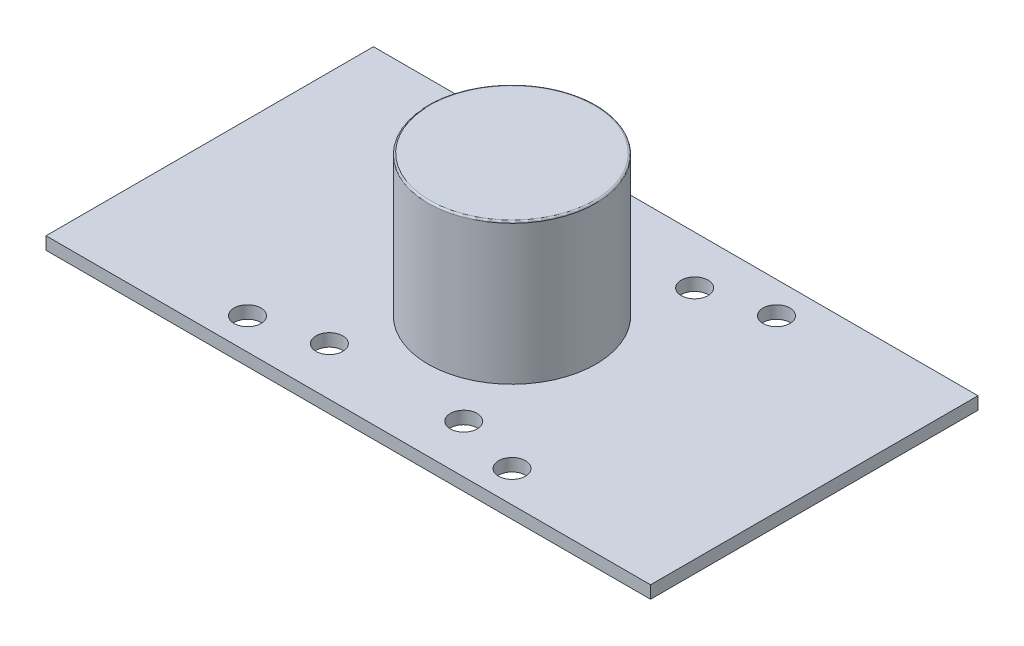
ISO-10303-21;
HEADER;
FILE_DESCRIPTION(('STEP AP214'),'2;1');
FILE_NAME('part.step','',(''),(''),'','','');
FILE_SCHEMA(('AUTOMOTIVE_DESIGN { 1 0 10303 214 1 1 1 1 }'));
ENDSEC;
DATA;
#1=APPLICATION_CONTEXT('core data for automotive mechanical design processes');
#2=APPLICATION_PROTOCOL_DEFINITION('international standard','automotive_design',2000,#1);
#3=PRODUCT_CONTEXT('',#1,'mechanical');
#4=PRODUCT('Part','Part','',(#3));
#5=PRODUCT_RELATED_PRODUCT_CATEGORY('part','',(#4));
#6=PRODUCT_DEFINITION_FORMATION('','',#4);
#7=PRODUCT_DEFINITION_CONTEXT('part definition',#1,'design');
#8=PRODUCT_DEFINITION('design','',#6,#7);
#9=PRODUCT_DEFINITION_SHAPE('','',#8);
#10=(LENGTH_UNIT() NAMED_UNIT(*) SI_UNIT(.MILLI.,.METRE.));
#11=(NAMED_UNIT(*) PLANE_ANGLE_UNIT() SI_UNIT($,.RADIAN.));
#12=(NAMED_UNIT(*) SI_UNIT($,.STERADIAN.) SOLID_ANGLE_UNIT());
#13=UNCERTAINTY_MEASURE_WITH_UNIT(LENGTH_MEASURE(1.E-05),#10,'distance_accuracy_value','');
#14=(GEOMETRIC_REPRESENTATION_CONTEXT(3) GLOBAL_UNCERTAINTY_ASSIGNED_CONTEXT((#13)) GLOBAL_UNIT_ASSIGNED_CONTEXT((#10,
#11,#12)) REPRESENTATION_CONTEXT('',''));
#15=CARTESIAN_POINT('',(0.,0.,0.));
#16=DIRECTION('',(0.,0.,1.));
#17=DIRECTION('',(1.,0.,0.));
#18=AXIS2_PLACEMENT_3D('',#15,#16,#17);
#19=CARTESIAN_POINT('',(0.,1.5,-39.));
#20=DIRECTION('',(1.,0.,0.));
#21=DIRECTION('',(0.,0.,-1.));
#22=AXIS2_PLACEMENT_3D('',#19,#20,#21);
#23=PLANE('',#22);
#24=DIRECTION('',(0.,0.,1.));
#25=VECTOR('',#24,1.);
#26=CARTESIAN_POINT('',(0.,0.,-39.));
#27=LINE('',#26,#25);
#28=CARTESIAN_POINT('',(0.,0.,-39.));
#29=VERTEX_POINT('',#28);
#30=CARTESIAN_POINT('',(0.,0.,0.));
#31=VERTEX_POINT('',#30);
#32=EDGE_CURVE('E103',#29,#31,#27,.T.);
#33=ORIENTED_EDGE('',*,*,#32,.T.);
#34=DIRECTION('',(0.,-1.,0.));
#35=VECTOR('',#34,1.);
#36=CARTESIAN_POINT('',(0.,1.5,0.));
#37=LINE('',#36,#35);
#38=CARTESIAN_POINT('',(0.,1.5,0.));
#39=VERTEX_POINT('',#38);
#40=EDGE_CURVE('E94',#39,#31,#37,.T.);
#41=ORIENTED_EDGE('',*,*,#40,.F.);
#42=DIRECTION('',(0.,0.,1.));
#43=VECTOR('',#42,1.);
#44=CARTESIAN_POINT('',(0.,1.5,-39.));
#45=LINE('',#44,#43);
#46=CARTESIAN_POINT('',(0.,1.5,-39.));
#47=VERTEX_POINT('',#46);
#48=EDGE_CURVE('E88',#47,#39,#45,.T.);
#49=ORIENTED_EDGE('',*,*,#48,.F.);
#50=DIRECTION('',(0.,-1.,0.));
#51=VECTOR('',#50,1.);
#52=CARTESIAN_POINT('',(0.,1.5,-39.));
#53=LINE('',#52,#51);
#54=EDGE_CURVE('E99',#47,#29,#53,.T.);
#55=ORIENTED_EDGE('',*,*,#54,.T.);
#56=EDGE_LOOP('',(#33,#41,#49,#55));
#57=FACE_BOUND('',#56,.T.);
#58=ADVANCED_FACE('F35',(#57),#23,.F.);
#59=CARTESIAN_POINT('',(0.,1.5,0.));
#60=DIRECTION('',(0.,0.,-1.));
#61=DIRECTION('',(-1.,0.,0.));
#62=AXIS2_PLACEMENT_3D('',#59,#60,#61);
#63=PLANE('',#62);
#64=DIRECTION('',(1.,0.,0.));
#65=VECTOR('',#64,1.);
#66=CARTESIAN_POINT('',(0.,0.,0.));
#67=LINE('',#66,#65);
#68=CARTESIAN_POINT('',(72.,0.,0.));
#69=VERTEX_POINT('',#68);
#70=EDGE_CURVE('E93',#31,#69,#67,.T.);
#71=ORIENTED_EDGE('',*,*,#70,.T.);
#72=DIRECTION('',(0.,-1.,0.));
#73=VECTOR('',#72,1.);
#74=CARTESIAN_POINT('',(72.,1.5,0.));
#75=LINE('',#74,#73);
#76=CARTESIAN_POINT('',(72.,1.5,0.));
#77=VERTEX_POINT('',#76);
#78=EDGE_CURVE('E91',#77,#69,#75,.T.);
#79=ORIENTED_EDGE('',*,*,#78,.F.);
#80=DIRECTION('',(1.,0.,0.));
#81=VECTOR('',#80,1.);
#82=CARTESIAN_POINT('',(0.,1.5,0.));
#83=LINE('',#82,#81);
#84=EDGE_CURVE('E83',#39,#77,#83,.T.);
#85=ORIENTED_EDGE('',*,*,#84,.F.);
#86=ORIENTED_EDGE('',*,*,#40,.T.);
#87=EDGE_LOOP('',(#71,#79,#85,#86));
#88=FACE_BOUND('',#87,.T.);
#89=ADVANCED_FACE('F92',(#88),#63,.F.);
#90=CARTESIAN_POINT('',(72.,1.5,0.));
#91=DIRECTION('',(-1.,0.,0.));
#92=DIRECTION('',(0.,0.,1.));
#93=AXIS2_PLACEMENT_3D('',#90,#91,#92);
#94=PLANE('',#93);
#95=DIRECTION('',(0.,0.,-1.));
#96=VECTOR('',#95,1.);
#97=CARTESIAN_POINT('',(72.,0.,0.));
#98=LINE('',#97,#96);
#99=CARTESIAN_POINT('',(72.,0.,-39.));
#100=VERTEX_POINT('',#99);
#101=EDGE_CURVE('E69',#69,#100,#98,.T.);
#102=ORIENTED_EDGE('',*,*,#101,.T.);
#103=DIRECTION('',(0.,-1.,0.));
#104=VECTOR('',#103,1.);
#105=CARTESIAN_POINT('',(72.,1.5,-39.));
#106=LINE('',#105,#104);
#107=CARTESIAN_POINT('',(72.,1.5,-39.));
#108=VERTEX_POINT('',#107);
#109=EDGE_CURVE('E95',#108,#100,#106,.T.);
#110=ORIENTED_EDGE('',*,*,#109,.F.);
#111=DIRECTION('',(0.,0.,-1.));
#112=VECTOR('',#111,1.);
#113=CARTESIAN_POINT('',(72.,1.5,0.));
#114=LINE('',#113,#112);
#115=EDGE_CURVE('E86',#77,#108,#114,.T.);
#116=ORIENTED_EDGE('',*,*,#115,.F.);
#117=ORIENTED_EDGE('',*,*,#78,.T.);
#118=EDGE_LOOP('',(#102,#110,#116,#117));
#119=FACE_BOUND('',#118,.T.);
#120=ADVANCED_FACE('F97',(#119),#94,.F.);
#121=CARTESIAN_POINT('',(72.,1.5,-39.));
#122=DIRECTION('',(0.,0.,1.));
#123=DIRECTION('',(1.,0.,0.));
#124=AXIS2_PLACEMENT_3D('',#121,#122,#123);
#125=PLANE('',#124);
#126=DIRECTION('',(-1.,0.,0.));
#127=VECTOR('',#126,1.);
#128=CARTESIAN_POINT('',(72.,0.,-39.));
#129=LINE('',#128,#127);
#130=EDGE_CURVE('E75',#100,#29,#129,.T.);
#131=ORIENTED_EDGE('',*,*,#130,.T.);
#132=ORIENTED_EDGE('',*,*,#54,.F.);
#133=DIRECTION('',(-1.,0.,0.));
#134=VECTOR('',#133,1.);
#135=CARTESIAN_POINT('',(72.,1.5,-39.));
#136=LINE('',#135,#134);
#137=EDGE_CURVE('E52',#108,#47,#136,.T.);
#138=ORIENTED_EDGE('',*,*,#137,.F.);
#139=ORIENTED_EDGE('',*,*,#109,.T.);
#140=EDGE_LOOP('',(#131,#132,#138,#139));
#141=FACE_BOUND('',#140,.T.);
#142=ADVANCED_FACE('F175',(#141),#125,.F.);
#143=CARTESIAN_POINT('',(0.,1.5,0.));
#144=DIRECTION('',(0.,1.,0.));
#145=DIRECTION('',(0.,0.,1.));
#146=AXIS2_PLACEMENT_3D('',#143,#144,#145);
#147=PLANE('',#146);
#148=CARTESIAN_POINT('',(51.75,1.5,-35.25));
#149=DIRECTION('',(0.,1.,0.));
#150=DIRECTION('',(0.,0.,-1.));
#151=AXIS2_PLACEMENT_3D('',#148,#149,#150);
#152=CIRCLE('',#151,1.6);
#153=CARTESIAN_POINT('',(51.75,1.5,-36.85));
#154=VERTEX_POINT('',#153);
#155=EDGE_CURVE('E159',#154,#154,#152,.T.);
#156=ORIENTED_EDGE('',*,*,#155,.F.);
#157=EDGE_LOOP('',(#156));
#158=FACE_BOUND('',#157,.T.);
#159=CARTESIAN_POINT('',(20.25,1.5,-3.75));
#160=DIRECTION('',(0.,1.,0.));
#161=DIRECTION('',(0.,0.,-1.));
#162=AXIS2_PLACEMENT_3D('',#159,#160,#161);
#163=CIRCLE('',#162,1.6);
#164=CARTESIAN_POINT('',(20.25,1.5,-5.35));
#165=VERTEX_POINT('',#164);
#166=EDGE_CURVE('E160',#165,#165,#163,.T.);
#167=ORIENTED_EDGE('',*,*,#166,.F.);
#168=EDGE_LOOP('',(#167));
#169=FACE_BOUND('',#168,.T.);
#170=CARTESIAN_POINT('',(20.25,1.5,-35.25));
#171=DIRECTION('',(0.,1.,0.));
#172=DIRECTION('',(0.,0.,1.));
#173=AXIS2_PLACEMENT_3D('',#170,#171,#172);
#174=CIRCLE('',#173,1.6);
#175=CARTESIAN_POINT('',(20.25,1.5,-33.65));
#176=VERTEX_POINT('',#175);
#177=EDGE_CURVE('E163',#176,#176,#174,.T.);
#178=ORIENTED_EDGE('',*,*,#177,.F.);
#179=EDGE_LOOP('',(#178));
#180=FACE_BOUND('',#179,.T.);
#181=CARTESIAN_POINT('',(51.75,1.5,-3.75));
#182=DIRECTION('',(0.,1.,0.));
#183=DIRECTION('',(0.,0.,1.));
#184=AXIS2_PLACEMENT_3D('',#181,#182,#183);
#185=CIRCLE('',#184,1.6);
#186=CARTESIAN_POINT('',(51.75,1.5,-2.15));
#187=VERTEX_POINT('',#186);
#188=EDGE_CURVE('E130',#187,#187,#185,.T.);
#189=ORIENTED_EDGE('',*,*,#188,.F.);
#190=EDGE_LOOP('',(#189));
#191=FACE_BOUND('',#190,.T.);
#192=CARTESIAN_POINT('',(44.,1.5,-33.25));
#193=DIRECTION('',(0.,1.,0.));
#194=DIRECTION('',(0.,0.,-1.));
#195=AXIS2_PLACEMENT_3D('',#192,#193,#194);
#196=CIRCLE('',#195,1.6);
#197=CARTESIAN_POINT('',(44.,1.5,-34.85));
#198=VERTEX_POINT('',#197);
#199=EDGE_CURVE('E138',#198,#198,#196,.T.);
#200=ORIENTED_EDGE('',*,*,#199,.F.);
#201=EDGE_LOOP('',(#200));
#202=FACE_BOUND('',#201,.T.);
#203=CARTESIAN_POINT('',(28.,1.5,-33.25));
#204=DIRECTION('',(0.,1.,0.));
#205=DIRECTION('',(0.,0.,1.));
#206=AXIS2_PLACEMENT_3D('',#203,#204,#205);
#207=CIRCLE('',#206,1.6);
#208=CARTESIAN_POINT('',(28.,1.5,-31.65));
#209=VERTEX_POINT('',#208);
#210=EDGE_CURVE('E152',#209,#209,#207,.T.);
#211=ORIENTED_EDGE('',*,*,#210,.F.);
#212=EDGE_LOOP('',(#211));
#213=FACE_BOUND('',#212,.T.);
#214=CARTESIAN_POINT('',(28.,1.5,-5.75));
#215=DIRECTION('',(0.,1.,0.));
#216=DIRECTION('',(0.,0.,-1.));
#217=AXIS2_PLACEMENT_3D('',#214,#215,#216);
#218=CIRCLE('',#217,1.6);
#219=CARTESIAN_POINT('',(28.,1.5,-7.35));
#220=VERTEX_POINT('',#219);
#221=EDGE_CURVE('E149',#220,#220,#218,.T.);
#222=ORIENTED_EDGE('',*,*,#221,.F.);
#223=EDGE_LOOP('',(#222));
#224=FACE_BOUND('',#223,.T.);
#225=CARTESIAN_POINT('',(44.,1.5,-5.75));
#226=DIRECTION('',(0.,1.,0.));
#227=DIRECTION('',(0.,0.,1.));
#228=AXIS2_PLACEMENT_3D('',#225,#226,#227);
#229=CIRCLE('',#228,1.6);
#230=CARTESIAN_POINT('',(44.,1.5,-4.15));
#231=VERTEX_POINT('',#230);
#232=EDGE_CURVE('E118',#231,#231,#229,.T.);
#233=ORIENTED_EDGE('',*,*,#232,.F.);
#234=EDGE_LOOP('',(#233));
#235=FACE_BOUND('',#234,.T.);
#236=CARTESIAN_POINT('',(36.,1.5,-19.5));
#237=DIRECTION('',(0.,1.,0.));
#238=DIRECTION('',(0.,0.,1.));
#239=AXIS2_PLACEMENT_3D('',#236,#237,#238);
#240=CIRCLE('',#239,10.);
#241=CARTESIAN_POINT('',(36.,1.5,-9.5));
#242=VERTEX_POINT('',#241);
#243=EDGE_CURVE('E113',#242,#242,#240,.T.);
#244=ORIENTED_EDGE('',*,*,#243,.F.);
#245=EDGE_LOOP('',(#244));
#246=FACE_BOUND('',#245,.T.);
#247=ORIENTED_EDGE('',*,*,#48,.T.);
#248=ORIENTED_EDGE('',*,*,#84,.T.);
#249=ORIENTED_EDGE('',*,*,#115,.T.);
#250=ORIENTED_EDGE('',*,*,#137,.T.);
#251=EDGE_LOOP('',(#247,#248,#249,#250));
#252=FACE_BOUND('',#251,.T.);
#253=ADVANCED_FACE('F84',(#158,#169,#180,#191,#202,#213,#224,#235,#246,#252),#147,.T.);
#254=CARTESIAN_POINT('',(0.,0.,0.));
#255=DIRECTION('',(0.,1.,0.));
#256=DIRECTION('',(0.,0.,1.));
#257=AXIS2_PLACEMENT_3D('',#254,#255,#256);
#258=PLANE('',#257);
#259=CARTESIAN_POINT('',(51.75,0.,-35.25));
#260=DIRECTION('',(0.,1.,0.));
#261=DIRECTION('',(0.,0.,1.));
#262=AXIS2_PLACEMENT_3D('',#259,#260,#261);
#263=CIRCLE('',#262,1.6);
#264=CARTESIAN_POINT('',(51.75,0.,-33.65));
#265=VERTEX_POINT('',#264);
#266=EDGE_CURVE('E136',#265,#265,#263,.T.);
#267=ORIENTED_EDGE('',*,*,#266,.T.);
#268=EDGE_LOOP('',(#267));
#269=FACE_BOUND('',#268,.T.);
#270=CARTESIAN_POINT('',(20.25,0.,-3.75));
#271=DIRECTION('',(0.,1.,0.));
#272=DIRECTION('',(0.,0.,1.));
#273=AXIS2_PLACEMENT_3D('',#270,#271,#272);
#274=CIRCLE('',#273,1.6);
#275=CARTESIAN_POINT('',(20.25,0.,-2.15));
#276=VERTEX_POINT('',#275);
#277=EDGE_CURVE('E133',#276,#276,#274,.T.);
#278=ORIENTED_EDGE('',*,*,#277,.T.);
#279=EDGE_LOOP('',(#278));
#280=FACE_BOUND('',#279,.T.);
#281=CARTESIAN_POINT('',(20.25,0.,-35.25));
#282=DIRECTION('',(0.,1.,0.));
#283=DIRECTION('',(0.,0.,1.));
#284=AXIS2_PLACEMENT_3D('',#281,#282,#283);
#285=CIRCLE('',#284,1.6);
#286=CARTESIAN_POINT('',(20.25,0.,-33.65));
#287=VERTEX_POINT('',#286);
#288=EDGE_CURVE('E129',#287,#287,#285,.T.);
#289=ORIENTED_EDGE('',*,*,#288,.T.);
#290=EDGE_LOOP('',(#289));
#291=FACE_BOUND('',#290,.T.);
#292=CARTESIAN_POINT('',(51.75,0.,-3.75));
#293=DIRECTION('',(0.,1.,0.));
#294=DIRECTION('',(0.,0.,1.));
#295=AXIS2_PLACEMENT_3D('',#292,#293,#294);
#296=CIRCLE('',#295,1.6);
#297=CARTESIAN_POINT('',(51.75,0.,-2.15));
#298=VERTEX_POINT('',#297);
#299=EDGE_CURVE('E126',#298,#298,#296,.T.);
#300=ORIENTED_EDGE('',*,*,#299,.T.);
#301=EDGE_LOOP('',(#300));
#302=FACE_BOUND('',#301,.T.);
#303=CARTESIAN_POINT('',(44.,0.,-33.25));
#304=DIRECTION('',(0.,1.,0.));
#305=DIRECTION('',(0.,0.,1.));
#306=AXIS2_PLACEMENT_3D('',#303,#304,#305);
#307=CIRCLE('',#306,1.6);
#308=CARTESIAN_POINT('',(44.,0.,-31.65));
#309=VERTEX_POINT('',#308);
#310=EDGE_CURVE('E106',#309,#309,#307,.T.);
#311=ORIENTED_EDGE('',*,*,#310,.T.);
#312=EDGE_LOOP('',(#311));
#313=FACE_BOUND('',#312,.T.);
#314=CARTESIAN_POINT('',(28.,0.,-33.25));
#315=DIRECTION('',(0.,1.,0.));
#316=DIRECTION('',(0.,0.,1.));
#317=AXIS2_PLACEMENT_3D('',#314,#315,#316);
#318=CIRCLE('',#317,1.6);
#319=CARTESIAN_POINT('',(28.,0.,-31.65));
#320=VERTEX_POINT('',#319);
#321=EDGE_CURVE('E121',#320,#320,#318,.T.);
#322=ORIENTED_EDGE('',*,*,#321,.T.);
#323=EDGE_LOOP('',(#322));
#324=FACE_BOUND('',#323,.T.);
#325=CARTESIAN_POINT('',(28.,0.,-5.75));
#326=DIRECTION('',(0.,1.,0.));
#327=DIRECTION('',(0.,0.,1.));
#328=AXIS2_PLACEMENT_3D('',#325,#326,#327);
#329=CIRCLE('',#328,1.6);
#330=CARTESIAN_POINT('',(28.,0.,-4.15));
#331=VERTEX_POINT('',#330);
#332=EDGE_CURVE('E117',#331,#331,#329,.T.);
#333=ORIENTED_EDGE('',*,*,#332,.T.);
#334=EDGE_LOOP('',(#333));
#335=FACE_BOUND('',#334,.T.);
#336=CARTESIAN_POINT('',(44.,0.,-5.75));
#337=DIRECTION('',(0.,1.,0.));
#338=DIRECTION('',(0.,0.,1.));
#339=AXIS2_PLACEMENT_3D('',#336,#337,#338);
#340=CIRCLE('',#339,1.6);
#341=CARTESIAN_POINT('',(44.,0.,-4.15));
#342=VERTEX_POINT('',#341);
#343=EDGE_CURVE('E114',#342,#342,#340,.T.);
#344=ORIENTED_EDGE('',*,*,#343,.T.);
#345=EDGE_LOOP('',(#344));
#346=FACE_BOUND('',#345,.T.);
#347=ORIENTED_EDGE('',*,*,#32,.F.);
#348=ORIENTED_EDGE('',*,*,#130,.F.);
#349=ORIENTED_EDGE('',*,*,#101,.F.);
#350=ORIENTED_EDGE('',*,*,#70,.F.);
#351=EDGE_LOOP('',(#347,#348,#349,#350));
#352=FACE_BOUND('',#351,.T.);
#353=ADVANCED_FACE('F174',(#269,#280,#291,#302,#313,#324,#335,#346,#352),#258,.F.);
#354=CARTESIAN_POINT('',(36.,18.3,-19.5));
#355=DIRECTION('',(0.,-1.,0.));
#356=DIRECTION('',(0.,0.,-1.));
#357=AXIS2_PLACEMENT_3D('',#354,#355,#356);
#358=CYLINDRICAL_SURFACE('',#357,10.);
#359=CARTESIAN_POINT('',(36.,18.1,-19.5));
#360=DIRECTION('',(0.,1.,0.));
#361=DIRECTION('',(0.,0.,1.));
#362=AXIS2_PLACEMENT_3D('',#359,#360,#361);
#363=CIRCLE('',#362,10.);
#364=CARTESIAN_POINT('',(36.,18.1,-9.5));
#365=VERTEX_POINT('',#364);
#366=EDGE_CURVE('E11',#365,#365,#363,.F.);
#367=ORIENTED_EDGE('',*,*,#366,.T.);
#368=EDGE_LOOP('',(#367));
#369=FACE_BOUND('',#368,.T.);
#370=ORIENTED_EDGE('',*,*,#243,.T.);
#371=EDGE_LOOP('',(#370));
#372=FACE_BOUND('',#371,.T.);
#373=ADVANCED_FACE('F199',(#369,#372),#358,.T.);
#374=CARTESIAN_POINT('',(36.,18.3,-19.5));
#375=DIRECTION('',(0.,1.,0.));
#376=DIRECTION('',(0.,0.,1.));
#377=AXIS2_PLACEMENT_3D('',#374,#375,#376);
#378=PLANE('',#377);
#379=CARTESIAN_POINT('',(36.,18.3,-19.5));
#380=DIRECTION('',(0.,1.,0.));
#381=DIRECTION('',(0.,0.,1.));
#382=AXIS2_PLACEMENT_3D('',#379,#380,#381);
#383=CIRCLE('',#382,9.8);
#384=CARTESIAN_POINT('',(36.,18.3,-9.7));
#385=VERTEX_POINT('',#384);
#386=EDGE_CURVE('E44',#385,#385,#383,.T.);
#387=ORIENTED_EDGE('',*,*,#386,.T.);
#388=EDGE_LOOP('',(#387));
#389=FACE_BOUND('',#388,.T.);
#390=ADVANCED_FACE('F193',(#389),#378,.T.);
#391=CARTESIAN_POINT('',(44.,-15.3,-5.75));
#392=DIRECTION('',(0.,1.,0.));
#393=DIRECTION('',(0.,0.,1.));
#394=AXIS2_PLACEMENT_3D('',#391,#392,#393);
#395=CYLINDRICAL_SURFACE('',#394,1.6);
#396=ORIENTED_EDGE('',*,*,#232,.T.);
#397=EDGE_LOOP('',(#396));
#398=FACE_BOUND('',#397,.T.);
#399=ORIENTED_EDGE('',*,*,#343,.F.);
#400=EDGE_LOOP('',(#399));
#401=FACE_BOUND('',#400,.T.);
#402=ADVANCED_FACE('F189',(#398,#401),#395,.F.);
#403=CARTESIAN_POINT('',(28.,-15.3,-5.75));
#404=DIRECTION('',(0.,1.,0.));
#405=DIRECTION('',(0.,0.,1.));
#406=AXIS2_PLACEMENT_3D('',#403,#404,#405);
#407=CYLINDRICAL_SURFACE('',#406,1.6);
#408=ORIENTED_EDGE('',*,*,#221,.T.);
#409=EDGE_LOOP('',(#408));
#410=FACE_BOUND('',#409,.T.);
#411=ORIENTED_EDGE('',*,*,#332,.F.);
#412=EDGE_LOOP('',(#411));
#413=FACE_BOUND('',#412,.T.);
#414=ADVANCED_FACE('F192',(#410,#413),#407,.F.);
#415=CARTESIAN_POINT('',(28.,-15.3,-33.25));
#416=DIRECTION('',(0.,1.,0.));
#417=DIRECTION('',(0.,0.,1.));
#418=AXIS2_PLACEMENT_3D('',#415,#416,#417);
#419=CYLINDRICAL_SURFACE('',#418,1.6);
#420=ORIENTED_EDGE('',*,*,#210,.T.);
#421=EDGE_LOOP('',(#420));
#422=FACE_BOUND('',#421,.T.);
#423=ORIENTED_EDGE('',*,*,#321,.F.);
#424=EDGE_LOOP('',(#423));
#425=FACE_BOUND('',#424,.T.);
#426=ADVANCED_FACE('F243',(#422,#425),#419,.F.);
#427=CARTESIAN_POINT('',(44.,-15.3,-33.25));
#428=DIRECTION('',(0.,1.,0.));
#429=DIRECTION('',(0.,0.,1.));
#430=AXIS2_PLACEMENT_3D('',#427,#428,#429);
#431=CYLINDRICAL_SURFACE('',#430,1.6);
#432=ORIENTED_EDGE('',*,*,#199,.T.);
#433=EDGE_LOOP('',(#432));
#434=FACE_BOUND('',#433,.T.);
#435=ORIENTED_EDGE('',*,*,#310,.F.);
#436=EDGE_LOOP('',(#435));
#437=FACE_BOUND('',#436,.T.);
#438=ADVANCED_FACE('F253',(#434,#437),#431,.F.);
#439=CARTESIAN_POINT('',(51.75,-15.3,-3.75));
#440=DIRECTION('',(0.,1.,0.));
#441=DIRECTION('',(0.,0.,1.));
#442=AXIS2_PLACEMENT_3D('',#439,#440,#441);
#443=CYLINDRICAL_SURFACE('',#442,1.6);
#444=ORIENTED_EDGE('',*,*,#188,.T.);
#445=EDGE_LOOP('',(#444));
#446=FACE_BOUND('',#445,.T.);
#447=ORIENTED_EDGE('',*,*,#299,.F.);
#448=EDGE_LOOP('',(#447));
#449=FACE_BOUND('',#448,.T.);
#450=ADVANCED_FACE('F263',(#446,#449),#443,.F.);
#451=CARTESIAN_POINT('',(20.25,-15.3,-35.25));
#452=DIRECTION('',(0.,1.,0.));
#453=DIRECTION('',(0.,0.,1.));
#454=AXIS2_PLACEMENT_3D('',#451,#452,#453);
#455=CYLINDRICAL_SURFACE('',#454,1.6);
#456=ORIENTED_EDGE('',*,*,#177,.T.);
#457=EDGE_LOOP('',(#456));
#458=FACE_BOUND('',#457,.T.);
#459=ORIENTED_EDGE('',*,*,#288,.F.);
#460=EDGE_LOOP('',(#459));
#461=FACE_BOUND('',#460,.T.);
#462=ADVANCED_FACE('F169',(#458,#461),#455,.F.);
#463=CARTESIAN_POINT('',(20.25,-15.3,-3.75));
#464=DIRECTION('',(0.,1.,0.));
#465=DIRECTION('',(0.,0.,1.));
#466=AXIS2_PLACEMENT_3D('',#463,#464,#465);
#467=CYLINDRICAL_SURFACE('',#466,1.6);
#468=ORIENTED_EDGE('',*,*,#166,.T.);
#469=EDGE_LOOP('',(#468));
#470=FACE_BOUND('',#469,.T.);
#471=ORIENTED_EDGE('',*,*,#277,.F.);
#472=EDGE_LOOP('',(#471));
#473=FACE_BOUND('',#472,.T.);
#474=ADVANCED_FACE('F295',(#470,#473),#467,.F.);
#475=CARTESIAN_POINT('',(51.75,-15.3,-35.25));
#476=DIRECTION('',(0.,1.,0.));
#477=DIRECTION('',(0.,0.,1.));
#478=AXIS2_PLACEMENT_3D('',#475,#476,#477);
#479=CYLINDRICAL_SURFACE('',#478,1.6);
#480=ORIENTED_EDGE('',*,*,#155,.T.);
#481=EDGE_LOOP('',(#480));
#482=FACE_BOUND('',#481,.T.);
#483=ORIENTED_EDGE('',*,*,#266,.F.);
#484=EDGE_LOOP('',(#483));
#485=FACE_BOUND('',#484,.T.);
#486=ADVANCED_FACE('F304',(#482,#485),#479,.F.);
#487=CARTESIAN_POINT('',(36.,18.1,-19.5));
#488=DIRECTION('',(0.,1.,0.));
#489=DIRECTION('',(0.,0.,1.));
#490=AXIS2_PLACEMENT_3D('',#487,#488,#489);
#491=TOROIDAL_SURFACE('',#490,9.8,0.2);
#492=ORIENTED_EDGE('',*,*,#366,.F.);
#493=EDGE_LOOP('',(#492));
#494=FACE_BOUND('',#493,.T.);
#495=ORIENTED_EDGE('',*,*,#386,.F.);
#496=EDGE_LOOP('',(#495));
#497=FACE_BOUND('',#496,.T.);
#498=ADVANCED_FACE('F37',(#494,#497),#491,.T.);
#499=CLOSED_SHELL('',(#58,#89,#120,#142,#253,#353,#373,#390,#402,#414,#426,#438,#450,#462,#474,
#486,#498));
#500=MANIFOLD_SOLID_BREP('B2',#499);
#501=ADVANCED_BREP_SHAPE_REPRESENTATION('',(#18,#500),#14);
#502=SHAPE_DEFINITION_REPRESENTATION(#9,#501);
ENDSEC;
END-ISO-10303-21;
